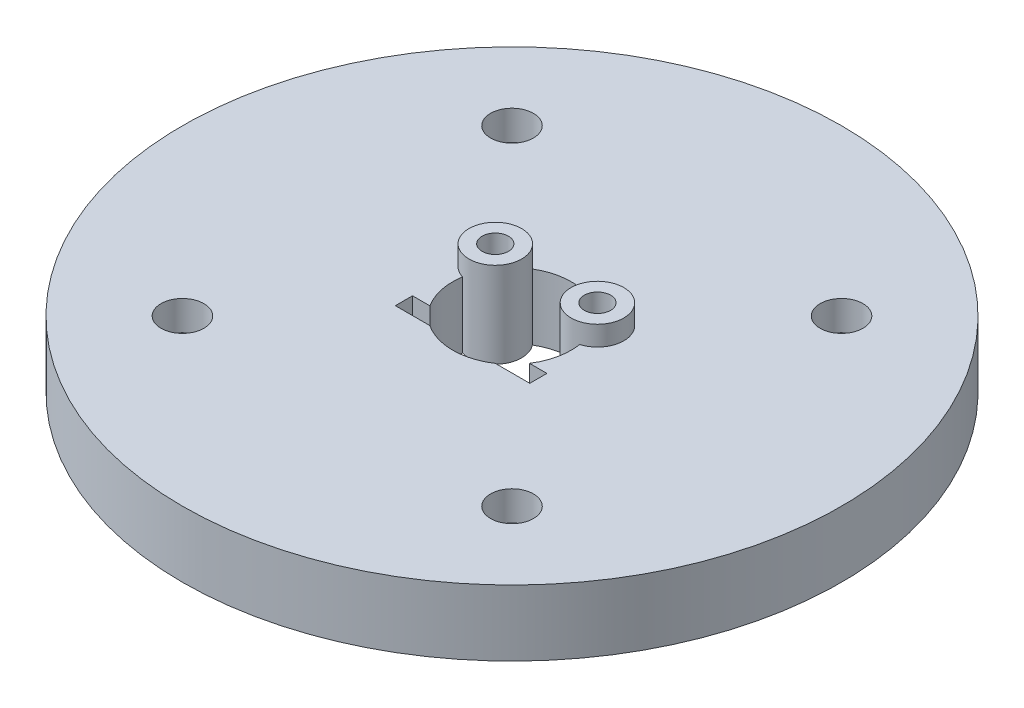
ISO-10303-21;
HEADER;
FILE_DESCRIPTION(('STEP AP214'),'2;1');
FILE_NAME('part.step','',(''),(''),'','','');
FILE_SCHEMA(('AUTOMOTIVE_DESIGN { 1 0 10303 214 1 1 1 1 }'));
ENDSEC;
DATA;
#1=APPLICATION_CONTEXT('core data for automotive mechanical design processes');
#2=APPLICATION_PROTOCOL_DEFINITION('international standard','automotive_design',2000,#1);
#3=PRODUCT_CONTEXT('',#1,'mechanical');
#4=PRODUCT('Part','Part','',(#3));
#5=PRODUCT_RELATED_PRODUCT_CATEGORY('part','',(#4));
#6=PRODUCT_DEFINITION_FORMATION('','',#4);
#7=PRODUCT_DEFINITION_CONTEXT('part definition',#1,'design');
#8=PRODUCT_DEFINITION('design','',#6,#7);
#9=PRODUCT_DEFINITION_SHAPE('','',#8);
#10=(LENGTH_UNIT() NAMED_UNIT(*) SI_UNIT(.MILLI.,.METRE.));
#11=(NAMED_UNIT(*) PLANE_ANGLE_UNIT() SI_UNIT($,.RADIAN.));
#12=(NAMED_UNIT(*) SI_UNIT($,.STERADIAN.) SOLID_ANGLE_UNIT());
#13=UNCERTAINTY_MEASURE_WITH_UNIT(LENGTH_MEASURE(1.E-05),#10,'distance_accuracy_value','');
#14=(GEOMETRIC_REPRESENTATION_CONTEXT(3) GLOBAL_UNCERTAINTY_ASSIGNED_CONTEXT((#13)) GLOBAL_UNIT_ASSIGNED_CONTEXT((#10,
#11,#12)) REPRESENTATION_CONTEXT('',''));
#15=CARTESIAN_POINT('',(0.,0.,0.));
#16=DIRECTION('',(0.,0.,1.));
#17=DIRECTION('',(1.,0.,0.));
#18=AXIS2_PLACEMENT_3D('',#15,#16,#17);
#19=CARTESIAN_POINT('',(0.,10.,0.));
#20=DIRECTION('',(0.,-1.,0.));
#21=DIRECTION('',(0.,0.,-1.));
#22=AXIS2_PLACEMENT_3D('',#19,#20,#21);
#23=CYLINDRICAL_SURFACE('',#22,9.);
#24=DIRECTION('',(0.,-1.,0.));
#25=VECTOR('',#24,1.);
#26=CARTESIAN_POINT('',(8.89328081917543,6.4999999960855,-1.38186695136921));
#27=LINE('',#26,#25);
#28=CARTESIAN_POINT('',(8.89328081917543,0.,-1.38186695136921));
#29=VERTEX_POINT('',#28);
#30=CARTESIAN_POINT('',(8.89328081917543,10.,-1.38186695136921));
#31=VERTEX_POINT('',#30);
#32=EDGE_CURVE('E269',#29,#31,#27,.F.);
#33=ORIENTED_EDGE('',*,*,#32,.F.);
#34=CARTESIAN_POINT('',(0.,0.,0.));
#35=DIRECTION('',(0.,-1.,0.));
#36=DIRECTION('',(0.,0.,-1.));
#37=AXIS2_PLACEMENT_3D('',#34,#35,#36);
#38=CIRCLE('',#37,9.);
#39=CARTESIAN_POINT('',(7.54917214004291,0.,4.9));
#40=VERTEX_POINT('',#39);
#41=EDGE_CURVE('E182',#29,#40,#38,.T.);
#42=ORIENTED_EDGE('',*,*,#41,.T.);
#43=DIRECTION('',(0.,-1.,0.));
#44=VECTOR('',#43,1.);
#45=CARTESIAN_POINT('',(7.54917214004291,10.,4.9));
#46=LINE('',#45,#44);
#47=CARTESIAN_POINT('',(7.54917214004291,10.,4.9));
#48=VERTEX_POINT('',#47);
#49=EDGE_CURVE('E11',#40,#48,#46,.F.);
#50=ORIENTED_EDGE('',*,*,#49,.T.);
#51=CARTESIAN_POINT('',(0.,10.,0.));
#52=DIRECTION('',(0.,-1.,0.));
#53=DIRECTION('',(0.,0.,-1.));
#54=AXIS2_PLACEMENT_3D('',#51,#52,#53);
#55=CIRCLE('',#54,9.);
#56=EDGE_CURVE('E192',#31,#48,#55,.T.);
#57=ORIENTED_EDGE('',*,*,#56,.F.);
#58=EDGE_LOOP('',(#33,#42,#50,#57));
#59=FACE_BOUND('',#58,.T.);
#60=ADVANCED_FACE('F39',(#59),#23,.F.);
#61=DIRECTION('',(0.,-1.,0.));
#62=VECTOR('',#61,1.);
#63=CARTESIAN_POINT('',(4.62978084313971,6.4999999960855,-7.7178448639822));
#64=LINE('',#63,#62);
#65=CARTESIAN_POINT('',(4.62978084313972,10.,-7.7178448639822));
#66=VERTEX_POINT('',#65);
#67=CARTESIAN_POINT('',(4.62978084313972,0.,-7.7178448639822));
#68=VERTEX_POINT('',#67);
#69=EDGE_CURVE('E62',#66,#68,#64,.T.);
#70=ORIENTED_EDGE('',*,*,#69,.F.);
#71=CARTESIAN_POINT('',(-4.62978084313972,10.,-7.7178448639822));
#72=VERTEX_POINT('',#71);
#73=EDGE_CURVE('E191',#72,#66,#55,.T.);
#74=ORIENTED_EDGE('',*,*,#73,.F.);
#75=DIRECTION('',(0.,-1.,0.));
#76=VECTOR('',#75,1.);
#77=CARTESIAN_POINT('',(-4.62978084313971,6.4999999960855,-7.7178448639822));
#78=LINE('',#77,#76);
#79=CARTESIAN_POINT('',(-4.62978084313972,0.,-7.7178448639822));
#80=VERTEX_POINT('',#79);
#81=EDGE_CURVE('E166',#80,#72,#78,.F.);
#82=ORIENTED_EDGE('',*,*,#81,.F.);
#83=EDGE_CURVE('E196',#80,#68,#38,.T.);
#84=ORIENTED_EDGE('',*,*,#83,.T.);
#85=EDGE_LOOP('',(#70,#74,#82,#84));
#86=FACE_BOUND('',#85,.T.);
#87=ADVANCED_FACE('F284',(#86),#23,.F.);
#88=CARTESIAN_POINT('',(0.,10.,0.));
#89=DIRECTION('',(0.,1.,0.));
#90=DIRECTION('',(0.,0.,1.));
#91=AXIS2_PLACEMENT_3D('',#88,#89,#90);
#92=PLANE('',#91);
#93=CARTESIAN_POINT('',(-25.0000000000003,10.,24.9999999999997));
#94=DIRECTION('',(0.,1.,0.));
#95=DIRECTION('',(0.,0.,1.));
#96=AXIS2_PLACEMENT_3D('',#93,#94,#95);
#97=CIRCLE('',#96,3.25);
#98=CARTESIAN_POINT('',(-25.0000000000003,10.,28.2499999999997));
#99=VERTEX_POINT('',#98);
#100=EDGE_CURVE('E210',#99,#99,#97,.T.);
#101=ORIENTED_EDGE('',*,*,#100,.F.);
#102=EDGE_LOOP('',(#101));
#103=FACE_BOUND('',#102,.T.);
#104=CARTESIAN_POINT('',(24.9999999999998,10.,25.0000000000002));
#105=DIRECTION('',(0.,1.,0.));
#106=DIRECTION('',(0.,0.,1.));
#107=AXIS2_PLACEMENT_3D('',#104,#105,#106);
#108=CIRCLE('',#107,3.25);
#109=CARTESIAN_POINT('',(24.9999999999998,10.,28.2500000000002));
#110=VERTEX_POINT('',#109);
#111=EDGE_CURVE('E204',#110,#110,#108,.T.);
#112=ORIENTED_EDGE('',*,*,#111,.F.);
#113=EDGE_LOOP('',(#112));
#114=FACE_BOUND('',#113,.T.);
#115=CARTESIAN_POINT('',(25.0000000000001,10.,-24.9999999999999));
#116=DIRECTION('',(0.,1.,0.));
#117=DIRECTION('',(0.,0.,1.));
#118=AXIS2_PLACEMENT_3D('',#115,#116,#117);
#119=CIRCLE('',#118,3.25);
#120=CARTESIAN_POINT('',(25.0000000000001,10.,-21.7499999999999));
#121=VERTEX_POINT('',#120);
#122=EDGE_CURVE('E197',#121,#121,#119,.T.);
#123=ORIENTED_EDGE('',*,*,#122,.F.);
#124=EDGE_LOOP('',(#123));
#125=FACE_BOUND('',#124,.T.);
#126=CARTESIAN_POINT('',(-25.,10.,-25.));
#127=DIRECTION('',(0.,1.,0.));
#128=DIRECTION('',(0.,0.,1.));
#129=AXIS2_PLACEMENT_3D('',#126,#127,#128);
#130=CIRCLE('',#129,3.25);
#131=CARTESIAN_POINT('',(-25.,10.,-21.75));
#132=VERTEX_POINT('',#131);
#133=EDGE_CURVE('E200',#132,#132,#130,.T.);
#134=ORIENTED_EDGE('',*,*,#133,.F.);
#135=EDGE_LOOP('',(#134));
#136=FACE_BOUND('',#135,.T.);
#137=CARTESIAN_POINT('',(0.,10.,0.));
#138=DIRECTION('',(0.,1.,0.));
#139=DIRECTION('',(0.,0.,1.));
#140=AXIS2_PLACEMENT_3D('',#137,#138,#139);
#141=CIRCLE('',#140,50.);
#142=CARTESIAN_POINT('',(0.,10.,50.));
#143=VERTEX_POINT('',#142);
#144=EDGE_CURVE('E236',#143,#143,#141,.T.);
#145=ORIENTED_EDGE('',*,*,#144,.T.);
#146=EDGE_LOOP('',(#145));
#147=FACE_BOUND('',#146,.T.);
#148=ORIENTED_EDGE('',*,*,#73,.T.);
#149=CARTESIAN_POINT('',(7.75,10.,-5.215));
#150=DIRECTION('',(0.,1.,0.));
#151=DIRECTION('',(0.,0.,1.));
#152=AXIS2_PLACEMENT_3D('',#149,#150,#151);
#153=CIRCLE('',#152,4.);
#154=EDGE_CURVE('E54',#66,#31,#153,.F.);
#155=ORIENTED_EDGE('',*,*,#154,.T.);
#156=ORIENTED_EDGE('',*,*,#56,.T.);
#157=DIRECTION('',(-1.,0.,0.));
#158=VECTOR('',#157,1.);
#159=CARTESIAN_POINT('',(-10.2,10.,4.9));
#160=LINE('',#159,#158);
#161=CARTESIAN_POINT('',(10.2,10.,4.9));
#162=VERTEX_POINT('',#161);
#163=EDGE_CURVE('E159',#162,#48,#160,.T.);
#164=ORIENTED_EDGE('',*,*,#163,.F.);
#165=DIRECTION('',(0.,0.,-1.));
#166=VECTOR('',#165,1.);
#167=CARTESIAN_POINT('',(10.2,10.,7.5));
#168=LINE('',#167,#166);
#169=CARTESIAN_POINT('',(10.2,10.,7.5));
#170=VERTEX_POINT('',#169);
#171=EDGE_CURVE('E177',#170,#162,#168,.T.);
#172=ORIENTED_EDGE('',*,*,#171,.F.);
#173=DIRECTION('',(1.,0.,0.));
#174=VECTOR('',#173,1.);
#175=CARTESIAN_POINT('',(-10.2,10.,7.5));
#176=LINE('',#175,#174);
#177=CARTESIAN_POINT('',(4.9749371855331,10.,7.5));
#178=VERTEX_POINT('',#177);
#179=EDGE_CURVE('E174',#178,#170,#176,.T.);
#180=ORIENTED_EDGE('',*,*,#179,.F.);
#181=CARTESIAN_POINT('',(-4.9749371855331,10.,7.5));
#182=VERTEX_POINT('',#181);
#183=EDGE_CURVE('E190',#178,#182,#55,.T.);
#184=ORIENTED_EDGE('',*,*,#183,.T.);
#185=CARTESIAN_POINT('',(-10.2,10.,7.5));
#186=VERTEX_POINT('',#185);
#187=EDGE_CURVE('E175',#186,#182,#176,.T.);
#188=ORIENTED_EDGE('',*,*,#187,.F.);
#189=DIRECTION('',(0.,0.,1.));
#190=VECTOR('',#189,1.);
#191=CARTESIAN_POINT('',(-10.2,10.,7.5));
#192=LINE('',#191,#190);
#193=CARTESIAN_POINT('',(-10.2,10.,4.9));
#194=VERTEX_POINT('',#193);
#195=EDGE_CURVE('E137',#194,#186,#192,.T.);
#196=ORIENTED_EDGE('',*,*,#195,.F.);
#197=CARTESIAN_POINT('',(-7.54917214004291,10.,4.9));
#198=VERTEX_POINT('',#197);
#199=EDGE_CURVE('E163',#198,#194,#160,.T.);
#200=ORIENTED_EDGE('',*,*,#199,.F.);
#201=CARTESIAN_POINT('',(-8.89328081917543,10.,-1.38186695136921));
#202=VERTEX_POINT('',#201);
#203=EDGE_CURVE('E187',#198,#202,#55,.T.);
#204=ORIENTED_EDGE('',*,*,#203,.T.);
#205=CARTESIAN_POINT('',(-7.75,10.,-5.215));
#206=DIRECTION('',(0.,1.,0.));
#207=DIRECTION('',(0.,0.,1.));
#208=AXIS2_PLACEMENT_3D('',#205,#206,#207);
#209=CIRCLE('',#208,4.);
#210=EDGE_CURVE('E279',#202,#72,#209,.F.);
#211=ORIENTED_EDGE('',*,*,#210,.T.);
#212=EDGE_LOOP('',(#148,#155,#156,#164,#172,#180,#184,#188,#196,#200,#204,#211));
#213=FACE_BOUND('',#212,.T.);
#214=ADVANCED_FACE('F288',(#103,#114,#125,#136,#147,#213),#92,.T.);
#215=DIRECTION('',(0.,-1.,0.));
#216=VECTOR('',#215,1.);
#217=CARTESIAN_POINT('',(-8.89328081917543,6.4999999960855,-1.38186695136921));
#218=LINE('',#217,#216);
#219=CARTESIAN_POINT('',(-8.89328081917543,0.,-1.38186695136921));
#220=VERTEX_POINT('',#219);
#221=EDGE_CURVE('E281',#202,#220,#218,.T.);
#222=ORIENTED_EDGE('',*,*,#221,.F.);
#223=ORIENTED_EDGE('',*,*,#203,.F.);
#224=DIRECTION('',(0.,-1.,0.));
#225=VECTOR('',#224,1.);
#226=CARTESIAN_POINT('',(-7.54917214004291,10.,4.9));
#227=LINE('',#226,#225);
#228=CARTESIAN_POINT('',(-7.54917214004291,0.,4.9));
#229=VERTEX_POINT('',#228);
#230=EDGE_CURVE('E47',#198,#229,#227,.T.);
#231=ORIENTED_EDGE('',*,*,#230,.T.);
#232=EDGE_CURVE('E193',#229,#220,#38,.T.);
#233=ORIENTED_EDGE('',*,*,#232,.T.);
#234=EDGE_LOOP('',(#222,#223,#231,#233));
#235=FACE_BOUND('',#234,.T.);
#236=ADVANCED_FACE('F257',(#235),#23,.F.);
#237=CARTESIAN_POINT('',(-25.,-4.80832611206853,-25.));
#238=DIRECTION('',(0.,1.,0.));
#239=DIRECTION('',(0.,0.,1.));
#240=AXIS2_PLACEMENT_3D('',#237,#238,#239);
#241=CYLINDRICAL_SURFACE('',#240,1.7);
#242=CARTESIAN_POINT('',(-25.,0.,-25.));
#243=DIRECTION('',(0.,1.,0.));
#244=DIRECTION('',(0.,0.,1.));
#245=AXIS2_PLACEMENT_3D('',#242,#243,#244);
#246=CIRCLE('',#245,1.7);
#247=CARTESIAN_POINT('',(-25.,0.,-23.3));
#248=VERTEX_POINT('',#247);
#249=EDGE_CURVE('E225',#248,#248,#246,.F.);
#250=ORIENTED_EDGE('',*,*,#249,.T.);
#251=EDGE_LOOP('',(#250));
#252=FACE_BOUND('',#251,.T.);
#253=CARTESIAN_POINT('',(-25.,5.5,-25.));
#254=DIRECTION('',(0.,1.,0.));
#255=DIRECTION('',(0.,0.,1.));
#256=AXIS2_PLACEMENT_3D('',#253,#254,#255);
#257=CIRCLE('',#256,1.7);
#258=CARTESIAN_POINT('',(-25.,5.5,-23.3));
#259=VERTEX_POINT('',#258);
#260=EDGE_CURVE('E232',#259,#259,#257,.F.);
#261=ORIENTED_EDGE('',*,*,#260,.F.);
#262=EDGE_LOOP('',(#261));
#263=FACE_BOUND('',#262,.T.);
#264=ADVANCED_FACE('F358',(#252,#263),#241,.F.);
#265=CARTESIAN_POINT('',(25.0000000000001,-4.80832611206853,-24.9999999999999));
#266=DIRECTION('',(0.,1.,0.));
#267=DIRECTION('',(0.,0.,1.));
#268=AXIS2_PLACEMENT_3D('',#265,#266,#267);
#269=CYLINDRICAL_SURFACE('',#268,1.7);
#270=CARTESIAN_POINT('',(25.0000000000001,0.,-24.9999999999999));
#271=DIRECTION('',(0.,1.,0.));
#272=DIRECTION('',(0.,0.,1.));
#273=AXIS2_PLACEMENT_3D('',#270,#271,#272);
#274=CIRCLE('',#273,1.7);
#275=CARTESIAN_POINT('',(25.0000000000001,0.,-23.2999999999999));
#276=VERTEX_POINT('',#275);
#277=EDGE_CURVE('E222',#276,#276,#274,.F.);
#278=ORIENTED_EDGE('',*,*,#277,.T.);
#279=EDGE_LOOP('',(#278));
#280=FACE_BOUND('',#279,.T.);
#281=CARTESIAN_POINT('',(25.0000000000001,5.5,-24.9999999999999));
#282=DIRECTION('',(0.,1.,0.));
#283=DIRECTION('',(0.,0.,1.));
#284=AXIS2_PLACEMENT_3D('',#281,#282,#283);
#285=CIRCLE('',#284,1.7);
#286=CARTESIAN_POINT('',(25.0000000000001,5.5,-23.2999999999999));
#287=VERTEX_POINT('',#286);
#288=EDGE_CURVE('E247',#287,#287,#285,.F.);
#289=ORIENTED_EDGE('',*,*,#288,.F.);
#290=EDGE_LOOP('',(#289));
#291=FACE_BOUND('',#290,.T.);
#292=ADVANCED_FACE('F364',(#280,#291),#269,.F.);
#293=CARTESIAN_POINT('',(24.9999999999998,-4.80832611206853,25.0000000000002));
#294=DIRECTION('',(0.,1.,0.));
#295=DIRECTION('',(0.,0.,1.));
#296=AXIS2_PLACEMENT_3D('',#293,#294,#295);
#297=CYLINDRICAL_SURFACE('',#296,1.7);
#298=CARTESIAN_POINT('',(24.9999999999998,0.,25.0000000000002));
#299=DIRECTION('',(0.,1.,0.));
#300=DIRECTION('',(0.,0.,1.));
#301=AXIS2_PLACEMENT_3D('',#298,#299,#300);
#302=CIRCLE('',#301,1.7);
#303=CARTESIAN_POINT('',(24.9999999999998,0.,26.7000000000002));
#304=VERTEX_POINT('',#303);
#305=EDGE_CURVE('E226',#304,#304,#302,.F.);
#306=ORIENTED_EDGE('',*,*,#305,.T.);
#307=EDGE_LOOP('',(#306));
#308=FACE_BOUND('',#307,.T.);
#309=CARTESIAN_POINT('',(24.9999999999998,5.5,25.0000000000002));
#310=DIRECTION('',(0.,1.,0.));
#311=DIRECTION('',(0.,0.,1.));
#312=AXIS2_PLACEMENT_3D('',#309,#310,#311);
#313=CIRCLE('',#312,1.7);
#314=CARTESIAN_POINT('',(24.9999999999998,5.5,26.7000000000002));
#315=VERTEX_POINT('',#314);
#316=EDGE_CURVE('E244',#315,#315,#313,.F.);
#317=ORIENTED_EDGE('',*,*,#316,.F.);
#318=EDGE_LOOP('',(#317));
#319=FACE_BOUND('',#318,.T.);
#320=ADVANCED_FACE('F387',(#308,#319),#297,.F.);
#321=CARTESIAN_POINT('',(-25.0000000000003,-4.80832611206853,24.9999999999997));
#322=DIRECTION('',(0.,1.,0.));
#323=DIRECTION('',(0.,0.,1.));
#324=AXIS2_PLACEMENT_3D('',#321,#322,#323);
#325=CYLINDRICAL_SURFACE('',#324,1.7);
#326=CARTESIAN_POINT('',(-25.0000000000003,0.,24.9999999999997));
#327=DIRECTION('',(0.,1.,0.));
#328=DIRECTION('',(0.,0.,1.));
#329=AXIS2_PLACEMENT_3D('',#326,#327,#328);
#330=CIRCLE('',#329,1.7);
#331=CARTESIAN_POINT('',(-25.0000000000003,0.,26.6999999999998));
#332=VERTEX_POINT('',#331);
#333=EDGE_CURVE('E229',#332,#332,#330,.F.);
#334=ORIENTED_EDGE('',*,*,#333,.T.);
#335=EDGE_LOOP('',(#334));
#336=FACE_BOUND('',#335,.T.);
#337=CARTESIAN_POINT('',(-25.0000000000003,5.5,24.9999999999997));
#338=DIRECTION('',(0.,1.,0.));
#339=DIRECTION('',(0.,0.,1.));
#340=AXIS2_PLACEMENT_3D('',#337,#338,#339);
#341=CIRCLE('',#340,1.7);
#342=CARTESIAN_POINT('',(-25.0000000000003,5.5,26.6999999999998));
#343=VERTEX_POINT('',#342);
#344=EDGE_CURVE('E219',#343,#343,#341,.F.);
#345=ORIENTED_EDGE('',*,*,#344,.F.);
#346=EDGE_LOOP('',(#345));
#347=FACE_BOUND('',#346,.T.);
#348=ADVANCED_FACE('F382',(#336,#347),#325,.F.);
#349=CARTESIAN_POINT('',(0.,10.,0.));
#350=DIRECTION('',(0.,-1.,0.));
#351=DIRECTION('',(0.,0.,-1.));
#352=AXIS2_PLACEMENT_3D('',#349,#350,#351);
#353=CYLINDRICAL_SURFACE('',#352,50.);
#354=ORIENTED_EDGE('',*,*,#144,.F.);
#355=EDGE_LOOP('',(#354));
#356=FACE_BOUND('',#355,.T.);
#357=CARTESIAN_POINT('',(0.,0.,0.));
#358=DIRECTION('',(0.,1.,0.));
#359=DIRECTION('',(0.,0.,1.));
#360=AXIS2_PLACEMENT_3D('',#357,#358,#359);
#361=CIRCLE('',#360,50.);
#362=CARTESIAN_POINT('',(0.,0.,50.));
#363=VERTEX_POINT('',#362);
#364=EDGE_CURVE('E235',#363,#363,#361,.T.);
#365=ORIENTED_EDGE('',*,*,#364,.T.);
#366=EDGE_LOOP('',(#365));
#367=FACE_BOUND('',#366,.T.);
#368=ADVANCED_FACE('F41',(#356,#367),#353,.T.);
#369=CARTESIAN_POINT('',(0.,0.,0.));
#370=DIRECTION('',(0.,1.,0.));
#371=DIRECTION('',(0.,0.,1.));
#372=AXIS2_PLACEMENT_3D('',#369,#370,#371);
#373=PLANE('',#372);
#374=ORIENTED_EDGE('',*,*,#41,.F.);
#375=CARTESIAN_POINT('',(7.75,0.,-5.215));
#376=DIRECTION('',(0.,1.,0.));
#377=DIRECTION('',(0.,0.,1.));
#378=AXIS2_PLACEMENT_3D('',#375,#376,#377);
#379=CIRCLE('',#378,4.);
#380=EDGE_CURVE('E304',#29,#68,#379,.F.);
#381=ORIENTED_EDGE('',*,*,#380,.T.);
#382=ORIENTED_EDGE('',*,*,#83,.F.);
#383=CARTESIAN_POINT('',(-7.75,0.,-5.215));
#384=DIRECTION('',(0.,1.,0.));
#385=DIRECTION('',(0.,0.,1.));
#386=AXIS2_PLACEMENT_3D('',#383,#384,#385);
#387=CIRCLE('',#386,4.);
#388=EDGE_CURVE('E264',#80,#220,#387,.F.);
#389=ORIENTED_EDGE('',*,*,#388,.T.);
#390=ORIENTED_EDGE('',*,*,#232,.F.);
#391=DIRECTION('',(-1.,0.,0.));
#392=VECTOR('',#391,1.);
#393=CARTESIAN_POINT('',(-10.2,0.,4.9));
#394=LINE('',#393,#392);
#395=CARTESIAN_POINT('',(-10.2,0.,4.9));
#396=VERTEX_POINT('',#395);
#397=EDGE_CURVE('E158',#229,#396,#394,.T.);
#398=ORIENTED_EDGE('',*,*,#397,.T.);
#399=DIRECTION('',(0.,0.,1.));
#400=VECTOR('',#399,1.);
#401=CARTESIAN_POINT('',(-10.2,0.,7.5));
#402=LINE('',#401,#400);
#403=CARTESIAN_POINT('',(-10.2,0.,7.5));
#404=VERTEX_POINT('',#403);
#405=EDGE_CURVE('E134',#396,#404,#402,.T.);
#406=ORIENTED_EDGE('',*,*,#405,.T.);
#407=DIRECTION('',(1.,0.,0.));
#408=VECTOR('',#407,1.);
#409=CARTESIAN_POINT('',(-10.2,0.,7.5));
#410=LINE('',#409,#408);
#411=CARTESIAN_POINT('',(-4.9749371855331,0.,7.5));
#412=VERTEX_POINT('',#411);
#413=EDGE_CURVE('E144',#404,#412,#410,.T.);
#414=ORIENTED_EDGE('',*,*,#413,.T.);
#415=CARTESIAN_POINT('',(4.9749371855331,0.,7.5));
#416=VERTEX_POINT('',#415);
#417=EDGE_CURVE('E195',#416,#412,#38,.T.);
#418=ORIENTED_EDGE('',*,*,#417,.F.);
#419=CARTESIAN_POINT('',(10.2,0.,7.5));
#420=VERTEX_POINT('',#419);
#421=EDGE_CURVE('E152',#416,#420,#410,.T.);
#422=ORIENTED_EDGE('',*,*,#421,.T.);
#423=DIRECTION('',(0.,0.,-1.));
#424=VECTOR('',#423,1.);
#425=CARTESIAN_POINT('',(10.2,0.,7.5));
#426=LINE('',#425,#424);
#427=CARTESIAN_POINT('',(10.2,0.,4.9));
#428=VERTEX_POINT('',#427);
#429=EDGE_CURVE('E151',#420,#428,#426,.T.);
#430=ORIENTED_EDGE('',*,*,#429,.T.);
#431=EDGE_CURVE('E141',#428,#40,#394,.T.);
#432=ORIENTED_EDGE('',*,*,#431,.T.);
#433=EDGE_LOOP('',(#374,#381,#382,#389,#390,#398,#406,#414,#418,#422,#430,#432));
#434=FACE_BOUND('',#433,.T.);
#435=ORIENTED_EDGE('',*,*,#333,.F.);
#436=EDGE_LOOP('',(#435));
#437=FACE_BOUND('',#436,.T.);
#438=ORIENTED_EDGE('',*,*,#305,.F.);
#439=EDGE_LOOP('',(#438));
#440=FACE_BOUND('',#439,.T.);
#441=ORIENTED_EDGE('',*,*,#277,.F.);
#442=EDGE_LOOP('',(#441));
#443=FACE_BOUND('',#442,.T.);
#444=ORIENTED_EDGE('',*,*,#249,.F.);
#445=EDGE_LOOP('',(#444));
#446=FACE_BOUND('',#445,.T.);
#447=ORIENTED_EDGE('',*,*,#364,.F.);
#448=EDGE_LOOP('',(#447));
#449=FACE_BOUND('',#448,.T.);
#450=ADVANCED_FACE('F155',(#434,#437,#440,#443,#446,#449),#373,.F.);
#451=CARTESIAN_POINT('',(-25.0000000000003,5.5,24.9999999999997));
#452=DIRECTION('',(0.,1.,0.));
#453=DIRECTION('',(0.,0.,1.));
#454=AXIS2_PLACEMENT_3D('',#451,#452,#453);
#455=PLANE('',#454);
#456=CARTESIAN_POINT('',(-25.0000000000003,5.5,24.9999999999997));
#457=DIRECTION('',(0.,1.,0.));
#458=DIRECTION('',(0.,0.,1.));
#459=AXIS2_PLACEMENT_3D('',#456,#457,#458);
#460=CIRCLE('',#459,3.25);
#461=CARTESIAN_POINT('',(-25.0000000000003,5.5,28.2499999999997));
#462=VERTEX_POINT('',#461);
#463=EDGE_CURVE('E213',#462,#462,#460,.T.);
#464=ORIENTED_EDGE('',*,*,#463,.T.);
#465=EDGE_LOOP('',(#464));
#466=FACE_BOUND('',#465,.T.);
#467=ORIENTED_EDGE('',*,*,#344,.T.);
#468=EDGE_LOOP('',(#467));
#469=FACE_BOUND('',#468,.T.);
#470=ADVANCED_FACE('F374',(#466,#469),#455,.T.);
#471=CARTESIAN_POINT('',(-25.0000000000003,5.5,24.9999999999997));
#472=DIRECTION('',(0.,1.,0.));
#473=DIRECTION('',(0.,0.,1.));
#474=AXIS2_PLACEMENT_3D('',#471,#472,#473);
#475=CYLINDRICAL_SURFACE('',#474,3.25);
#476=ORIENTED_EDGE('',*,*,#463,.F.);
#477=EDGE_LOOP('',(#476));
#478=FACE_BOUND('',#477,.T.);
#479=ORIENTED_EDGE('',*,*,#100,.T.);
#480=EDGE_LOOP('',(#479));
#481=FACE_BOUND('',#480,.T.);
#482=ADVANCED_FACE('F378',(#478,#481),#475,.F.);
#483=CARTESIAN_POINT('',(24.9999999999998,5.5,25.0000000000002));
#484=DIRECTION('',(0.,1.,0.));
#485=DIRECTION('',(0.,0.,1.));
#486=AXIS2_PLACEMENT_3D('',#483,#484,#485);
#487=PLANE('',#486);
#488=CARTESIAN_POINT('',(24.9999999999998,5.5,25.0000000000002));
#489=DIRECTION('',(0.,1.,0.));
#490=DIRECTION('',(0.,0.,1.));
#491=AXIS2_PLACEMENT_3D('',#488,#489,#490);
#492=CIRCLE('',#491,3.25);
#493=CARTESIAN_POINT('',(24.9999999999998,5.5,28.2500000000002));
#494=VERTEX_POINT('',#493);
#495=EDGE_CURVE('E207',#494,#494,#492,.T.);
#496=ORIENTED_EDGE('',*,*,#495,.T.);
#497=EDGE_LOOP('',(#496));
#498=FACE_BOUND('',#497,.T.);
#499=ORIENTED_EDGE('',*,*,#316,.T.);
#500=EDGE_LOOP('',(#499));
#501=FACE_BOUND('',#500,.T.);
#502=ADVANCED_FACE('F410',(#498,#501),#487,.T.);
#503=CARTESIAN_POINT('',(24.9999999999998,5.5,25.0000000000002));
#504=DIRECTION('',(0.,1.,0.));
#505=DIRECTION('',(0.,0.,1.));
#506=AXIS2_PLACEMENT_3D('',#503,#504,#505);
#507=CYLINDRICAL_SURFACE('',#506,3.25);
#508=ORIENTED_EDGE('',*,*,#495,.F.);
#509=EDGE_LOOP('',(#508));
#510=FACE_BOUND('',#509,.T.);
#511=ORIENTED_EDGE('',*,*,#111,.T.);
#512=EDGE_LOOP('',(#511));
#513=FACE_BOUND('',#512,.T.);
#514=ADVANCED_FACE('F414',(#510,#513),#507,.F.);
#515=CARTESIAN_POINT('',(25.0000000000001,5.5,-24.9999999999999));
#516=DIRECTION('',(0.,1.,0.));
#517=DIRECTION('',(0.,0.,1.));
#518=AXIS2_PLACEMENT_3D('',#515,#516,#517);
#519=PLANE('',#518);
#520=CARTESIAN_POINT('',(25.0000000000001,5.5,-24.9999999999999));
#521=DIRECTION('',(0.,1.,0.));
#522=DIRECTION('',(0.,0.,1.));
#523=AXIS2_PLACEMENT_3D('',#520,#521,#522);
#524=CIRCLE('',#523,3.25);
#525=CARTESIAN_POINT('',(25.0000000000001,5.5,-21.7499999999999));
#526=VERTEX_POINT('',#525);
#527=EDGE_CURVE('E201',#526,#526,#524,.T.);
#528=ORIENTED_EDGE('',*,*,#527,.T.);
#529=EDGE_LOOP('',(#528));
#530=FACE_BOUND('',#529,.T.);
#531=ORIENTED_EDGE('',*,*,#288,.T.);
#532=EDGE_LOOP('',(#531));
#533=FACE_BOUND('',#532,.T.);
#534=ADVANCED_FACE('F418',(#530,#533),#519,.T.);
#535=CARTESIAN_POINT('',(25.0000000000001,5.5,-24.9999999999999));
#536=DIRECTION('',(0.,1.,0.));
#537=DIRECTION('',(0.,0.,1.));
#538=AXIS2_PLACEMENT_3D('',#535,#536,#537);
#539=CYLINDRICAL_SURFACE('',#538,3.25);
#540=ORIENTED_EDGE('',*,*,#527,.F.);
#541=EDGE_LOOP('',(#540));
#542=FACE_BOUND('',#541,.T.);
#543=ORIENTED_EDGE('',*,*,#122,.T.);
#544=EDGE_LOOP('',(#543));
#545=FACE_BOUND('',#544,.T.);
#546=ADVANCED_FACE('F405',(#542,#545),#539,.F.);
#547=CARTESIAN_POINT('',(-25.,5.5,-25.));
#548=DIRECTION('',(0.,1.,0.));
#549=DIRECTION('',(0.,0.,1.));
#550=AXIS2_PLACEMENT_3D('',#547,#548,#549);
#551=PLANE('',#550);
#552=CARTESIAN_POINT('',(-25.,5.5,-25.));
#553=DIRECTION('',(0.,1.,0.));
#554=DIRECTION('',(0.,0.,1.));
#555=AXIS2_PLACEMENT_3D('',#552,#553,#554);
#556=CIRCLE('',#555,3.25);
#557=CARTESIAN_POINT('',(-25.,5.5,-21.75));
#558=VERTEX_POINT('',#557);
#559=EDGE_CURVE('E216',#558,#558,#556,.T.);
#560=ORIENTED_EDGE('',*,*,#559,.T.);
#561=EDGE_LOOP('',(#560));
#562=FACE_BOUND('',#561,.T.);
#563=ORIENTED_EDGE('',*,*,#260,.T.);
#564=EDGE_LOOP('',(#563));
#565=FACE_BOUND('',#564,.T.);
#566=ADVANCED_FACE('F354',(#562,#565),#551,.T.);
#567=CARTESIAN_POINT('',(-25.,5.5,-25.));
#568=DIRECTION('',(0.,1.,0.));
#569=DIRECTION('',(0.,0.,1.));
#570=AXIS2_PLACEMENT_3D('',#567,#568,#569);
#571=CYLINDRICAL_SURFACE('',#570,3.25);
#572=ORIENTED_EDGE('',*,*,#559,.F.);
#573=EDGE_LOOP('',(#572));
#574=FACE_BOUND('',#573,.T.);
#575=ORIENTED_EDGE('',*,*,#133,.T.);
#576=EDGE_LOOP('',(#575));
#577=FACE_BOUND('',#576,.T.);
#578=ADVANCED_FACE('F346',(#574,#577),#571,.F.);
#579=ORIENTED_EDGE('',*,*,#417,.T.);
#580=DIRECTION('',(0.,-1.,0.));
#581=VECTOR('',#580,1.);
#582=CARTESIAN_POINT('',(-4.9749371855331,10.,7.5));
#583=LINE('',#582,#581);
#584=EDGE_CURVE('E147',#412,#182,#583,.F.);
#585=ORIENTED_EDGE('',*,*,#584,.T.);
#586=ORIENTED_EDGE('',*,*,#183,.F.);
#587=DIRECTION('',(0.,-1.,0.));
#588=VECTOR('',#587,1.);
#589=CARTESIAN_POINT('',(4.9749371855331,10.,7.5));
#590=LINE('',#589,#588);
#591=EDGE_CURVE('E239',#178,#416,#590,.T.);
#592=ORIENTED_EDGE('',*,*,#591,.T.);
#593=EDGE_LOOP('',(#579,#585,#586,#592));
#594=FACE_BOUND('',#593,.T.);
#595=ADVANCED_FACE('F291',(#594),#23,.F.);
#596=CARTESIAN_POINT('',(-10.2,0.,4.9));
#597=DIRECTION('',(0.,0.,-1.));
#598=DIRECTION('',(-1.,0.,0.));
#599=AXIS2_PLACEMENT_3D('',#596,#597,#598);
#600=PLANE('',#599);
#601=ORIENTED_EDGE('',*,*,#431,.F.);
#602=DIRECTION('',(0.,1.,0.));
#603=VECTOR('',#602,1.);
#604=CARTESIAN_POINT('',(10.2,0.,4.9));
#605=LINE('',#604,#603);
#606=EDGE_CURVE('E183',#428,#162,#605,.T.);
#607=ORIENTED_EDGE('',*,*,#606,.T.);
#608=ORIENTED_EDGE('',*,*,#163,.T.);
#609=ORIENTED_EDGE('',*,*,#49,.F.);
#610=EDGE_LOOP('',(#601,#607,#608,#609));
#611=FACE_BOUND('',#610,.T.);
#612=ADVANCED_FACE('F297',(#611),#600,.F.);
#613=CARTESIAN_POINT('',(-10.2,0.,7.5));
#614=DIRECTION('',(0.,0.,1.));
#615=DIRECTION('',(1.,0.,0.));
#616=AXIS2_PLACEMENT_3D('',#613,#614,#615);
#617=PLANE('',#616);
#618=ORIENTED_EDGE('',*,*,#179,.T.);
#619=DIRECTION('',(0.,1.,0.));
#620=VECTOR('',#619,1.);
#621=CARTESIAN_POINT('',(10.2,0.,7.5));
#622=LINE('',#621,#620);
#623=EDGE_CURVE('E140',#420,#170,#622,.T.);
#624=ORIENTED_EDGE('',*,*,#623,.F.);
#625=ORIENTED_EDGE('',*,*,#421,.F.);
#626=ORIENTED_EDGE('',*,*,#591,.F.);
#627=EDGE_LOOP('',(#618,#624,#625,#626));
#628=FACE_BOUND('',#627,.T.);
#629=ADVANCED_FACE('F351',(#628),#617,.F.);
#630=CARTESIAN_POINT('',(10.2,0.,7.5));
#631=DIRECTION('',(1.,0.,0.));
#632=DIRECTION('',(0.,0.,-1.));
#633=AXIS2_PLACEMENT_3D('',#630,#631,#632);
#634=PLANE('',#633);
#635=ORIENTED_EDGE('',*,*,#171,.T.);
#636=ORIENTED_EDGE('',*,*,#606,.F.);
#637=ORIENTED_EDGE('',*,*,#429,.F.);
#638=ORIENTED_EDGE('',*,*,#623,.T.);
#639=EDGE_LOOP('',(#635,#636,#637,#638));
#640=FACE_BOUND('',#639,.T.);
#641=ADVANCED_FACE('F301',(#640),#634,.F.);
#642=ORIENTED_EDGE('',*,*,#199,.T.);
#643=DIRECTION('',(0.,1.,0.));
#644=VECTOR('',#643,1.);
#645=CARTESIAN_POINT('',(-10.2,0.,4.9));
#646=LINE('',#645,#644);
#647=EDGE_CURVE('E180',#396,#194,#646,.T.);
#648=ORIENTED_EDGE('',*,*,#647,.F.);
#649=ORIENTED_EDGE('',*,*,#397,.F.);
#650=ORIENTED_EDGE('',*,*,#230,.F.);
#651=EDGE_LOOP('',(#642,#648,#649,#650));
#652=FACE_BOUND('',#651,.T.);
#653=ADVANCED_FACE('F353',(#652),#600,.F.);
#654=ORIENTED_EDGE('',*,*,#413,.F.);
#655=DIRECTION('',(0.,1.,0.));
#656=VECTOR('',#655,1.);
#657=CARTESIAN_POINT('',(-10.2,0.,7.5));
#658=LINE('',#657,#656);
#659=EDGE_CURVE('E129',#404,#186,#658,.T.);
#660=ORIENTED_EDGE('',*,*,#659,.T.);
#661=ORIENTED_EDGE('',*,*,#187,.T.);
#662=ORIENTED_EDGE('',*,*,#584,.F.);
#663=EDGE_LOOP('',(#654,#660,#661,#662));
#664=FACE_BOUND('',#663,.T.);
#665=ADVANCED_FACE('F145',(#664),#617,.F.);
#666=CARTESIAN_POINT('',(-10.2,0.,7.5));
#667=DIRECTION('',(-1.,0.,0.));
#668=DIRECTION('',(0.,0.,1.));
#669=AXIS2_PLACEMENT_3D('',#666,#667,#668);
#670=PLANE('',#669);
#671=ORIENTED_EDGE('',*,*,#195,.T.);
#672=ORIENTED_EDGE('',*,*,#659,.F.);
#673=ORIENTED_EDGE('',*,*,#405,.F.);
#674=ORIENTED_EDGE('',*,*,#647,.T.);
#675=EDGE_LOOP('',(#671,#672,#673,#674));
#676=FACE_BOUND('',#675,.T.);
#677=ADVANCED_FACE('F131',(#676),#670,.F.);
#678=CARTESIAN_POINT('',(-7.75,24.3137084911558,-5.215));
#679=DIRECTION('',(0.,-1.,0.));
#680=DIRECTION('',(0.,0.,-1.));
#681=AXIS2_PLACEMENT_3D('',#678,#679,#680);
#682=CYLINDRICAL_SURFACE('',#681,4.);
#683=CARTESIAN_POINT('',(-7.75,12.999999992171,-5.215));
#684=DIRECTION('',(0.,1.,0.));
#685=DIRECTION('',(-1.,0.,0.));
#686=AXIS2_PLACEMENT_3D('',#683,#684,#685);
#687=CIRCLE('',#686,4.);
#688=CARTESIAN_POINT('',(-11.75,12.999999992171,-5.215));
#689=VERTEX_POINT('',#688);
#690=EDGE_CURVE('E272',#689,#689,#687,.T.);
#691=ORIENTED_EDGE('',*,*,#690,.F.);
#692=EDGE_LOOP('',(#691));
#693=FACE_BOUND('',#692,.T.);
#694=ORIENTED_EDGE('',*,*,#388,.F.);
#695=ORIENTED_EDGE('',*,*,#81,.T.);
#696=ORIENTED_EDGE('',*,*,#210,.F.);
#697=ORIENTED_EDGE('',*,*,#221,.T.);
#698=EDGE_LOOP('',(#694,#695,#696,#697));
#699=FACE_BOUND('',#698,.T.);
#700=ADVANCED_FACE('F283',(#693,#699),#682,.T.);
#701=CARTESIAN_POINT('',(-7.75,24.3137084911558,-5.215));
#702=DIRECTION('',(0.,-1.,0.));
#703=DIRECTION('',(0.,0.,-1.));
#704=AXIS2_PLACEMENT_3D('',#701,#702,#703);
#705=CYLINDRICAL_SURFACE('',#704,2.);
#706=CARTESIAN_POINT('',(-7.75,12.999999992171,-5.215));
#707=DIRECTION('',(0.,1.,0.));
#708=DIRECTION('',(-1.,0.,0.));
#709=AXIS2_PLACEMENT_3D('',#706,#707,#708);
#710=CIRCLE('',#709,2.);
#711=CARTESIAN_POINT('',(-9.75,12.999999992171,-5.215));
#712=VERTEX_POINT('',#711);
#713=EDGE_CURVE('E268',#712,#712,#710,.T.);
#714=ORIENTED_EDGE('',*,*,#713,.T.);
#715=EDGE_LOOP('',(#714));
#716=FACE_BOUND('',#715,.T.);
#717=CARTESIAN_POINT('',(-7.75,6.999999992171,-5.215));
#718=DIRECTION('',(0.,1.,0.));
#719=DIRECTION('',(-1.,0.,0.));
#720=AXIS2_PLACEMENT_3D('',#717,#718,#719);
#721=CIRCLE('',#720,2.);
#722=CARTESIAN_POINT('',(-9.75,6.999999992171,-5.215));
#723=VERTEX_POINT('',#722);
#724=EDGE_CURVE('E313',#723,#723,#721,.T.);
#725=ORIENTED_EDGE('',*,*,#724,.F.);
#726=EDGE_LOOP('',(#725));
#727=FACE_BOUND('',#726,.T.);
#728=ADVANCED_FACE('F323',(#716,#727),#705,.F.);
#729=CARTESIAN_POINT('',(0.,12.999999992171,0.302085325011));
#730=DIRECTION('',(0.,1.,0.));
#731=DIRECTION('',(0.,0.,-1.));
#732=AXIS2_PLACEMENT_3D('',#729,#730,#731);
#733=PLANE('',#732);
#734=ORIENTED_EDGE('',*,*,#713,.F.);
#735=EDGE_LOOP('',(#734));
#736=FACE_BOUND('',#735,.T.);
#737=ORIENTED_EDGE('',*,*,#690,.T.);
#738=EDGE_LOOP('',(#737));
#739=FACE_BOUND('',#738,.T.);
#740=ADVANCED_FACE('F325',(#736,#739),#733,.T.);
#741=CARTESIAN_POINT('',(7.75,24.3137084911558,-5.215));
#742=DIRECTION('',(0.,-1.,0.));
#743=DIRECTION('',(0.,0.,-1.));
#744=AXIS2_PLACEMENT_3D('',#741,#742,#743);
#745=CYLINDRICAL_SURFACE('',#744,4.);
#746=CARTESIAN_POINT('',(7.75,12.999999992171,-5.215));
#747=DIRECTION('',(0.,1.,0.));
#748=DIRECTION('',(-1.,0.,0.));
#749=AXIS2_PLACEMENT_3D('',#746,#747,#748);
#750=CIRCLE('',#749,4.);
#751=CARTESIAN_POINT('',(3.75,12.999999992171,-5.215));
#752=VERTEX_POINT('',#751);
#753=EDGE_CURVE('E309',#752,#752,#750,.T.);
#754=ORIENTED_EDGE('',*,*,#753,.F.);
#755=EDGE_LOOP('',(#754));
#756=FACE_BOUND('',#755,.T.);
#757=ORIENTED_EDGE('',*,*,#380,.F.);
#758=ORIENTED_EDGE('',*,*,#32,.T.);
#759=ORIENTED_EDGE('',*,*,#154,.F.);
#760=ORIENTED_EDGE('',*,*,#69,.T.);
#761=EDGE_LOOP('',(#757,#758,#759,#760));
#762=FACE_BOUND('',#761,.T.);
#763=ADVANCED_FACE('F303',(#756,#762),#745,.T.);
#764=CARTESIAN_POINT('',(7.75,24.3137084911558,-5.215));
#765=DIRECTION('',(0.,-1.,0.));
#766=DIRECTION('',(0.,0.,-1.));
#767=AXIS2_PLACEMENT_3D('',#764,#765,#766);
#768=CYLINDRICAL_SURFACE('',#767,2.);
#769=CARTESIAN_POINT('',(7.75,12.999999992171,-5.215));
#770=DIRECTION('',(0.,1.,0.));
#771=DIRECTION('',(-1.,0.,0.));
#772=AXIS2_PLACEMENT_3D('',#769,#770,#771);
#773=CIRCLE('',#772,2.);
#774=CARTESIAN_POINT('',(5.75,12.999999992171,-5.215));
#775=VERTEX_POINT('',#774);
#776=EDGE_CURVE('E305',#775,#775,#773,.T.);
#777=ORIENTED_EDGE('',*,*,#776,.T.);
#778=EDGE_LOOP('',(#777));
#779=FACE_BOUND('',#778,.T.);
#780=CARTESIAN_POINT('',(7.75,6.999999992171,-5.215));
#781=DIRECTION('',(0.,1.,0.));
#782=DIRECTION('',(-1.,0.,0.));
#783=AXIS2_PLACEMENT_3D('',#780,#781,#782);
#784=CIRCLE('',#783,2.);
#785=CARTESIAN_POINT('',(5.75,6.999999992171,-5.215));
#786=VERTEX_POINT('',#785);
#787=EDGE_CURVE('E315',#786,#786,#784,.T.);
#788=ORIENTED_EDGE('',*,*,#787,.F.);
#789=EDGE_LOOP('',(#788));
#790=FACE_BOUND('',#789,.T.);
#791=ADVANCED_FACE('F553',(#779,#790),#768,.F.);
#792=CARTESIAN_POINT('',(0.,12.999999992171,0.302085325011));
#793=DIRECTION('',(0.,1.,0.));
#794=DIRECTION('',(0.,0.,-1.));
#795=AXIS2_PLACEMENT_3D('',#792,#793,#794);
#796=PLANE('',#795);
#797=ORIENTED_EDGE('',*,*,#776,.F.);
#798=EDGE_LOOP('',(#797));
#799=FACE_BOUND('',#798,.T.);
#800=ORIENTED_EDGE('',*,*,#753,.T.);
#801=EDGE_LOOP('',(#800));
#802=FACE_BOUND('',#801,.T.);
#803=ADVANCED_FACE('F561',(#799,#802),#796,.T.);
#804=CARTESIAN_POINT('',(7.75,6.999999992171,-5.215));
#805=DIRECTION('',(0.,1.,0.));
#806=DIRECTION('',(-1.,0.,0.));
#807=AXIS2_PLACEMENT_3D('',#804,#805,#806);
#808=PLANE('',#807);
#809=ORIENTED_EDGE('',*,*,#787,.T.);
#810=EDGE_LOOP('',(#809));
#811=FACE_BOUND('',#810,.T.);
#812=ADVANCED_FACE('F572',(#811),#808,.T.);
#813=CARTESIAN_POINT('',(-7.75,6.999999992171,-5.215));
#814=DIRECTION('',(0.,1.,0.));
#815=DIRECTION('',(-1.,0.,0.));
#816=AXIS2_PLACEMENT_3D('',#813,#814,#815);
#817=PLANE('',#816);
#818=ORIENTED_EDGE('',*,*,#724,.T.);
#819=EDGE_LOOP('',(#818));
#820=FACE_BOUND('',#819,.T.);
#821=ADVANCED_FACE('F321',(#820),#817,.T.);
#822=CLOSED_SHELL('',(#60,#87,#214,#236,#264,#292,#320,#348,#368,#450,#470,#482,#502,#514,#534,
#546,#566,#578,#595,#612,#629,#641,#653,#665,#677,#700,#728,#740,#763,#791,#803,#812,#821));
#823=MANIFOLD_SOLID_BREP('B2',#822);
#824=ADVANCED_BREP_SHAPE_REPRESENTATION('',(#18,#823),#14);
#825=SHAPE_DEFINITION_REPRESENTATION(#9,#824);
ENDSEC;
END-ISO-10303-21;
